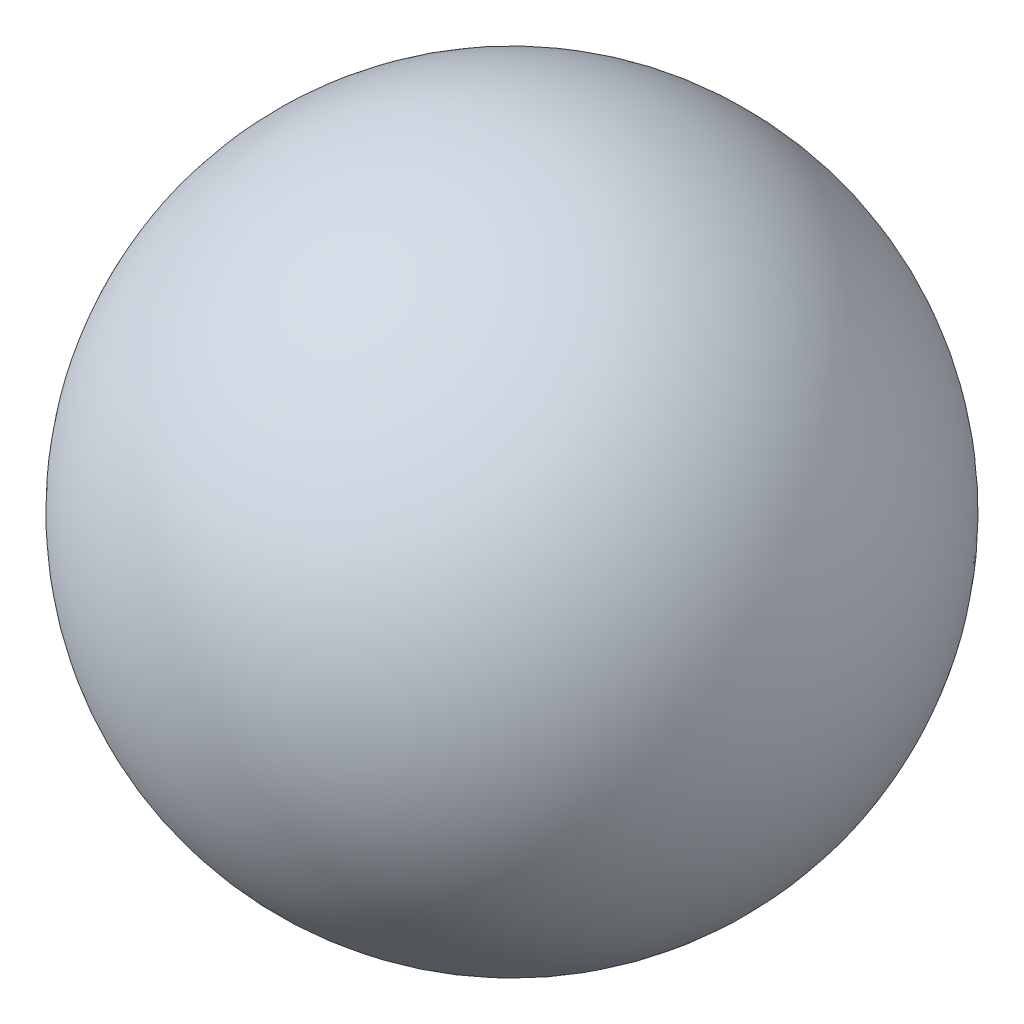
ISO-10303-21;
HEADER;
FILE_DESCRIPTION(('STEP AP214'),'2;1');
FILE_NAME('part.step','',(''),(''),'','','');
FILE_SCHEMA(('AUTOMOTIVE_DESIGN { 1 0 10303 214 1 1 1 1 }'));
ENDSEC;
DATA;
#1=APPLICATION_CONTEXT('core data for automotive mechanical design processes');
#2=APPLICATION_PROTOCOL_DEFINITION('international standard','automotive_design',2000,#1);
#3=PRODUCT_CONTEXT('',#1,'mechanical');
#4=PRODUCT('Part','Part','',(#3));
#5=PRODUCT_RELATED_PRODUCT_CATEGORY('part','',(#4));
#6=PRODUCT_DEFINITION_FORMATION('','',#4);
#7=PRODUCT_DEFINITION_CONTEXT('part definition',#1,'design');
#8=PRODUCT_DEFINITION('design','',#6,#7);
#9=PRODUCT_DEFINITION_SHAPE('','',#8);
#10=(LENGTH_UNIT() NAMED_UNIT(*) SI_UNIT(.MILLI.,.METRE.));
#11=(NAMED_UNIT(*) PLANE_ANGLE_UNIT() SI_UNIT($,.RADIAN.));
#12=(NAMED_UNIT(*) SI_UNIT($,.STERADIAN.) SOLID_ANGLE_UNIT());
#13=UNCERTAINTY_MEASURE_WITH_UNIT(LENGTH_MEASURE(1.E-05),#10,'distance_accuracy_value','');
#14=(GEOMETRIC_REPRESENTATION_CONTEXT(3) GLOBAL_UNCERTAINTY_ASSIGNED_CONTEXT((#13)) GLOBAL_UNIT_ASSIGNED_CONTEXT((#10,
#11,#12)) REPRESENTATION_CONTEXT('',''));
#15=CARTESIAN_POINT('',(0.,0.,0.));
#16=DIRECTION('',(0.,0.,1.));
#17=DIRECTION('',(1.,0.,0.));
#18=AXIS2_PLACEMENT_3D('',#15,#16,#17);
#19=CARTESIAN_POINT('',(0.,0.,0.));
#20=DIRECTION('',(1.,0.,0.));
#21=DIRECTION('',(0.,0.,-1.));
#22=AXIS2_PLACEMENT_3D('',#19,#20,#21);
#23=SPHERICAL_SURFACE('',#22,127.);
#24=CARTESIAN_POINT('',(-127.,0.,0.));
#25=VERTEX_POINT('',#24);
#26=VERTEX_LOOP('',#25);
#27=FACE_BOUND('',#26,.T.);
#28=CARTESIAN_POINT('',(127.,0.,0.));
#29=VERTEX_POINT('',#28);
#30=VERTEX_LOOP('',#29);
#31=FACE_BOUND('',#30,.T.);
#32=ADVANCED_FACE('F20',(#27,#31),#23,.T.);
#33=CLOSED_SHELL('',(#32));
#34=MANIFOLD_SOLID_BREP('B1',#33);
#35=ADVANCED_BREP_SHAPE_REPRESENTATION('',(#18,#34),#14);
#36=SHAPE_DEFINITION_REPRESENTATION(#9,#35);
ENDSEC;
END-ISO-10303-21;
